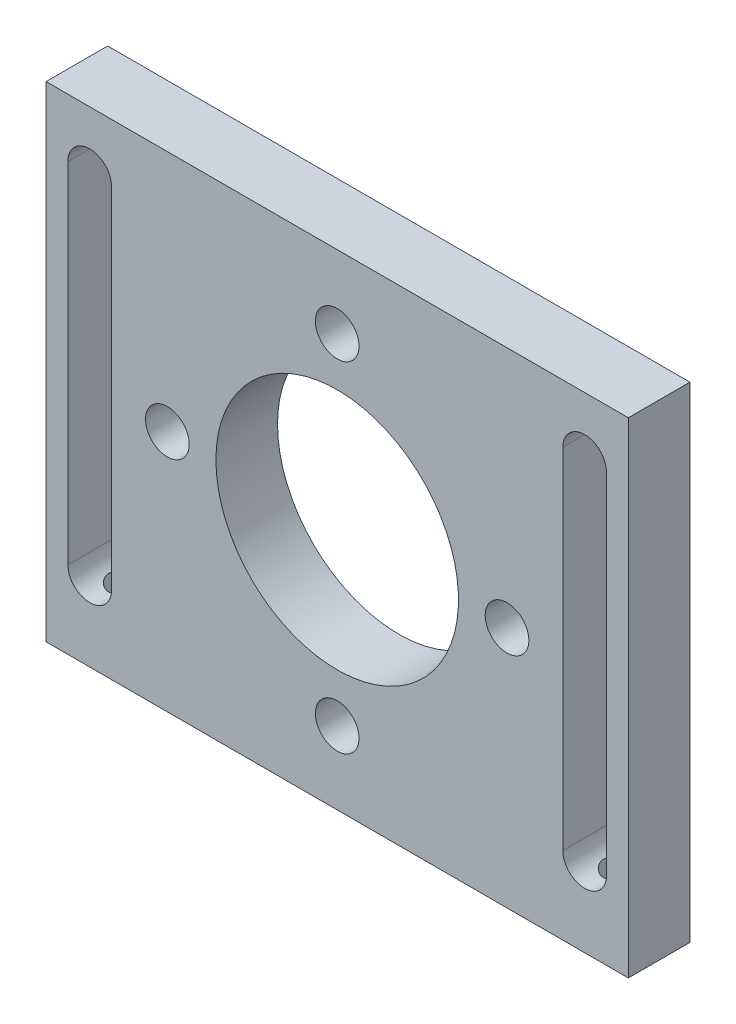
ISO-10303-21;
HEADER;
FILE_DESCRIPTION(('STEP AP214'),'2;1');
FILE_NAME('part.step','',(''),(''),'','','');
FILE_SCHEMA(('AUTOMOTIVE_DESIGN { 1 0 10303 214 1 1 1 1 }'));
ENDSEC;
DATA;
#1=APPLICATION_CONTEXT('core data for automotive mechanical design processes');
#2=APPLICATION_PROTOCOL_DEFINITION('international standard','automotive_design',2000,#1);
#3=PRODUCT_CONTEXT('',#1,'mechanical');
#4=PRODUCT('Part','Part','',(#3));
#5=PRODUCT_RELATED_PRODUCT_CATEGORY('part','',(#4));
#6=PRODUCT_DEFINITION_FORMATION('','',#4);
#7=PRODUCT_DEFINITION_CONTEXT('part definition',#1,'design');
#8=PRODUCT_DEFINITION('design','',#6,#7);
#9=PRODUCT_DEFINITION_SHAPE('','',#8);
#10=(LENGTH_UNIT() NAMED_UNIT(*) SI_UNIT(.MILLI.,.METRE.));
#11=(NAMED_UNIT(*) PLANE_ANGLE_UNIT() SI_UNIT($,.RADIAN.));
#12=(NAMED_UNIT(*) SI_UNIT($,.STERADIAN.) SOLID_ANGLE_UNIT());
#13=UNCERTAINTY_MEASURE_WITH_UNIT(LENGTH_MEASURE(1.E-05),#10,'distance_accuracy_value','');
#14=(GEOMETRIC_REPRESENTATION_CONTEXT(3) GLOBAL_UNCERTAINTY_ASSIGNED_CONTEXT((#13)) GLOBAL_UNIT_ASSIGNED_CONTEXT((#10,
#11,#12)) REPRESENTATION_CONTEXT('',''));
#15=CARTESIAN_POINT('',(0.,0.,0.));
#16=DIRECTION('',(0.,0.,1.));
#17=DIRECTION('',(1.,0.,0.));
#18=AXIS2_PLACEMENT_3D('',#15,#16,#17);
#19=CARTESIAN_POINT('',(30.,25.,6.35));
#20=DIRECTION('',(1.,0.,0.));
#21=DIRECTION('',(0.,1.,0.));
#22=AXIS2_PLACEMENT_3D('',#19,#20,#21);
#23=PLANE('',#22);
#24=DIRECTION('',(0.,-1.,0.));
#25=VECTOR('',#24,1.);
#26=CARTESIAN_POINT('',(30.,25.,0.));
#27=LINE('',#26,#25);
#28=CARTESIAN_POINT('',(30.,25.,0.));
#29=VERTEX_POINT('',#28);
#30=CARTESIAN_POINT('',(30.,-25.,0.));
#31=VERTEX_POINT('',#30);
#32=EDGE_CURVE('E186',#29,#31,#27,.T.);
#33=ORIENTED_EDGE('',*,*,#32,.F.);
#34=DIRECTION('',(0.,0.,-1.));
#35=VECTOR('',#34,1.);
#36=CARTESIAN_POINT('',(30.,25.,6.35));
#37=LINE('',#36,#35);
#38=CARTESIAN_POINT('',(30.,25.,6.35));
#39=VERTEX_POINT('',#38);
#40=EDGE_CURVE('E217',#39,#29,#37,.T.);
#41=ORIENTED_EDGE('',*,*,#40,.F.);
#42=DIRECTION('',(0.,-1.,0.));
#43=VECTOR('',#42,1.);
#44=CARTESIAN_POINT('',(30.,25.,6.35));
#45=LINE('',#44,#43);
#46=CARTESIAN_POINT('',(30.,-25.,6.35));
#47=VERTEX_POINT('',#46);
#48=EDGE_CURVE('E193',#39,#47,#45,.T.);
#49=ORIENTED_EDGE('',*,*,#48,.T.);
#50=DIRECTION('',(0.,0.,-1.));
#51=VECTOR('',#50,1.);
#52=CARTESIAN_POINT('',(30.,-25.,6.35));
#53=LINE('',#52,#51);
#54=EDGE_CURVE('E206',#47,#31,#53,.T.);
#55=ORIENTED_EDGE('',*,*,#54,.T.);
#56=EDGE_LOOP('',(#33,#41,#49,#55));
#57=FACE_BOUND('',#56,.T.);
#58=ADVANCED_FACE('F32',(#57),#23,.T.);
#59=CARTESIAN_POINT('',(-30.,25.,6.35));
#60=DIRECTION('',(0.,1.,0.));
#61=DIRECTION('',(0.,0.,1.));
#62=AXIS2_PLACEMENT_3D('',#59,#60,#61);
#63=PLANE('',#62);
#64=DIRECTION('',(1.,0.,0.));
#65=VECTOR('',#64,1.);
#66=CARTESIAN_POINT('',(-30.,25.,0.));
#67=LINE('',#66,#65);
#68=CARTESIAN_POINT('',(-30.,25.,0.));
#69=VERTEX_POINT('',#68);
#70=EDGE_CURVE('E197',#69,#29,#67,.T.);
#71=ORIENTED_EDGE('',*,*,#70,.F.);
#72=DIRECTION('',(0.,0.,-1.));
#73=VECTOR('',#72,1.);
#74=CARTESIAN_POINT('',(-30.,25.,6.35));
#75=LINE('',#74,#73);
#76=CARTESIAN_POINT('',(-30.,25.,6.35));
#77=VERTEX_POINT('',#76);
#78=EDGE_CURVE('E220',#77,#69,#75,.T.);
#79=ORIENTED_EDGE('',*,*,#78,.F.);
#80=DIRECTION('',(1.,0.,0.));
#81=VECTOR('',#80,1.);
#82=CARTESIAN_POINT('',(-30.,25.,6.35));
#83=LINE('',#82,#81);
#84=EDGE_CURVE('E203',#77,#39,#83,.T.);
#85=ORIENTED_EDGE('',*,*,#84,.T.);
#86=ORIENTED_EDGE('',*,*,#40,.T.);
#87=EDGE_LOOP('',(#71,#79,#85,#86));
#88=FACE_BOUND('',#87,.T.);
#89=ADVANCED_FACE('F261',(#88),#63,.T.);
#90=CARTESIAN_POINT('',(-30.,-25.,6.35));
#91=DIRECTION('',(-1.,0.,0.));
#92=DIRECTION('',(0.,-1.,0.));
#93=AXIS2_PLACEMENT_3D('',#90,#91,#92);
#94=PLANE('',#93);
#95=DIRECTION('',(0.,1.,0.));
#96=VECTOR('',#95,1.);
#97=CARTESIAN_POINT('',(-30.,-25.,0.));
#98=LINE('',#97,#96);
#99=CARTESIAN_POINT('',(-30.,-25.,0.));
#100=VERTEX_POINT('',#99);
#101=EDGE_CURVE('E212',#100,#69,#98,.T.);
#102=ORIENTED_EDGE('',*,*,#101,.F.);
#103=DIRECTION('',(0.,0.,-1.));
#104=VECTOR('',#103,1.);
#105=CARTESIAN_POINT('',(-30.,-25.,6.35));
#106=LINE('',#105,#104);
#107=CARTESIAN_POINT('',(-30.,-25.,6.35));
#108=VERTEX_POINT('',#107);
#109=EDGE_CURVE('E222',#108,#100,#106,.T.);
#110=ORIENTED_EDGE('',*,*,#109,.F.);
#111=DIRECTION('',(0.,1.,0.));
#112=VECTOR('',#111,1.);
#113=CARTESIAN_POINT('',(-30.,-25.,6.35));
#114=LINE('',#113,#112);
#115=EDGE_CURVE('E200',#108,#77,#114,.T.);
#116=ORIENTED_EDGE('',*,*,#115,.T.);
#117=ORIENTED_EDGE('',*,*,#78,.T.);
#118=EDGE_LOOP('',(#102,#110,#116,#117));
#119=FACE_BOUND('',#118,.T.);
#120=ADVANCED_FACE('F267',(#119),#94,.T.);
#121=CARTESIAN_POINT('',(30.,-25.,6.35));
#122=DIRECTION('',(0.,-1.,0.));
#123=DIRECTION('',(0.,0.,-1.));
#124=AXIS2_PLACEMENT_3D('',#121,#122,#123);
#125=PLANE('',#124);
#126=CARTESIAN_POINT('',(25.5,-25.,3.175));
#127=DIRECTION('',(0.,-1.,0.));
#128=DIRECTION('',(0.,0.,-1.));
#129=AXIS2_PLACEMENT_3D('',#126,#127,#128);
#130=CIRCLE('',#129,1.24999999999999);
#131=CARTESIAN_POINT('',(25.5,-25.,1.92500000000001));
#132=VERTEX_POINT('',#131);
#133=EDGE_CURVE('E335',#132,#132,#130,.T.);
#134=ORIENTED_EDGE('',*,*,#133,.F.);
#135=EDGE_LOOP('',(#134));
#136=FACE_BOUND('',#135,.T.);
#137=CARTESIAN_POINT('',(-25.5,-25.,3.175));
#138=DIRECTION('',(0.,-1.,0.));
#139=DIRECTION('',(0.,0.,-1.));
#140=AXIS2_PLACEMENT_3D('',#137,#138,#139);
#141=CIRCLE('',#140,1.24999999999999);
#142=CARTESIAN_POINT('',(-25.5,-25.,1.92500000000001));
#143=VERTEX_POINT('',#142);
#144=EDGE_CURVE('E319',#143,#143,#141,.T.);
#145=ORIENTED_EDGE('',*,*,#144,.F.);
#146=EDGE_LOOP('',(#145));
#147=FACE_BOUND('',#146,.T.);
#148=DIRECTION('',(-1.,0.,0.));
#149=VECTOR('',#148,1.);
#150=CARTESIAN_POINT('',(30.,-25.,0.));
#151=LINE('',#150,#149);
#152=EDGE_CURVE('E209',#31,#100,#151,.T.);
#153=ORIENTED_EDGE('',*,*,#152,.F.);
#154=ORIENTED_EDGE('',*,*,#54,.F.);
#155=DIRECTION('',(-1.,0.,0.));
#156=VECTOR('',#155,1.);
#157=CARTESIAN_POINT('',(30.,-25.,6.35));
#158=LINE('',#157,#156);
#159=EDGE_CURVE('E196',#47,#108,#158,.T.);
#160=ORIENTED_EDGE('',*,*,#159,.T.);
#161=ORIENTED_EDGE('',*,*,#109,.T.);
#162=EDGE_LOOP('',(#153,#154,#160,#161));
#163=FACE_BOUND('',#162,.T.);
#164=ADVANCED_FACE('F273',(#136,#147,#163),#125,.T.);
#165=CARTESIAN_POINT('',(0.,0.,6.35));
#166=DIRECTION('',(0.,0.,-1.));
#167=DIRECTION('',(-1.,0.,0.));
#168=AXIS2_PLACEMENT_3D('',#165,#166,#167);
#169=PLANE('',#168);
#170=CARTESIAN_POINT('',(0.,17.5,6.34999999999999));
#171=DIRECTION('',(0.,0.,-1.));
#172=DIRECTION('',(-1.,0.,0.));
#173=AXIS2_PLACEMENT_3D('',#170,#171,#172);
#174=CIRCLE('',#173,2.24999999999999);
#175=CARTESIAN_POINT('',(-2.24999999999999,17.5,6.34999999999999));
#176=VERTEX_POINT('',#175);
#177=EDGE_CURVE('E308',#176,#176,#174,.T.);
#178=ORIENTED_EDGE('',*,*,#177,.T.);
#179=EDGE_LOOP('',(#178));
#180=FACE_BOUND('',#179,.T.);
#181=CARTESIAN_POINT('',(-17.5000000000005,4.95236783133562E-13,6.34999999999999));
#182=DIRECTION('',(0.,0.,-1.));
#183=DIRECTION('',(-1.,0.,0.));
#184=AXIS2_PLACEMENT_3D('',#181,#182,#183);
#185=CIRCLE('',#184,2.24999999999999);
#186=CARTESIAN_POINT('',(-19.7500000000005,4.95236783133562E-13,6.34999999999999));
#187=VERTEX_POINT('',#186);
#188=EDGE_CURVE('E303',#187,#187,#185,.T.);
#189=ORIENTED_EDGE('',*,*,#188,.T.);
#190=EDGE_LOOP('',(#189));
#191=FACE_BOUND('',#190,.T.);
#192=CARTESIAN_POINT('',(-9.90473566267125E-13,-17.5,6.34999999999999));
#193=DIRECTION('',(0.,0.,-1.));
#194=DIRECTION('',(-1.,0.,0.));
#195=AXIS2_PLACEMENT_3D('',#192,#193,#194);
#196=CIRCLE('',#195,2.24999999999999);
#197=CARTESIAN_POINT('',(-2.25000000000098,-17.5,6.34999999999999));
#198=VERTEX_POINT('',#197);
#199=EDGE_CURVE('E299',#198,#198,#196,.T.);
#200=ORIENTED_EDGE('',*,*,#199,.T.);
#201=EDGE_LOOP('',(#200));
#202=FACE_BOUND('',#201,.T.);
#203=CARTESIAN_POINT('',(17.4999999999995,-4.93093651235055E-13,6.34999999999999));
#204=DIRECTION('',(0.,0.,-1.));
#205=DIRECTION('',(-1.,0.,0.));
#206=AXIS2_PLACEMENT_3D('',#203,#204,#205);
#207=CIRCLE('',#206,2.24999999999999);
#208=CARTESIAN_POINT('',(15.2499999999995,-4.93093651235055E-13,6.34999999999999));
#209=VERTEX_POINT('',#208);
#210=EDGE_CURVE('E296',#209,#209,#207,.T.);
#211=ORIENTED_EDGE('',*,*,#210,.T.);
#212=EDGE_LOOP('',(#211));
#213=FACE_BOUND('',#212,.T.);
#214=CARTESIAN_POINT('',(-1.11022302462516E-13,-1.11022302462516E-13,6.34999999999999));
#215=DIRECTION('',(0.,0.,-1.));
#216=DIRECTION('',(-1.,0.,0.));
#217=AXIS2_PLACEMENT_3D('',#214,#215,#216);
#218=CIRCLE('',#217,12.5000000000001);
#219=CARTESIAN_POINT('',(-12.5000000000002,-1.11022302462516E-13,6.34999999999999));
#220=VERTEX_POINT('',#219);
#221=EDGE_CURVE('E145',#220,#220,#218,.T.);
#222=ORIENTED_EDGE('',*,*,#221,.T.);
#223=EDGE_LOOP('',(#222));
#224=FACE_BOUND('',#223,.T.);
#225=DIRECTION('',(0.,1.,0.));
#226=VECTOR('',#225,1.);
#227=CARTESIAN_POINT('',(27.75,-17.,6.35));
#228=LINE('',#227,#226);
#229=CARTESIAN_POINT('',(27.75,-17.,6.35));
#230=VERTEX_POINT('',#229);
#231=CARTESIAN_POINT('',(27.75,19.,6.35));
#232=VERTEX_POINT('',#231);
#233=EDGE_CURVE('E151',#230,#232,#228,.T.);
#234=ORIENTED_EDGE('',*,*,#233,.F.);
#235=CARTESIAN_POINT('',(25.5,-17.,6.35));
#236=DIRECTION('',(0.,0.,1.));
#237=DIRECTION('',(1.,0.,0.));
#238=AXIS2_PLACEMENT_3D('',#235,#236,#237);
#239=CIRCLE('',#238,2.24999999999999);
#240=CARTESIAN_POINT('',(23.25,-17.,6.35));
#241=VERTEX_POINT('',#240);
#242=EDGE_CURVE('E47',#241,#230,#239,.T.);
#243=ORIENTED_EDGE('',*,*,#242,.F.);
#244=DIRECTION('',(0.,-1.,0.));
#245=VECTOR('',#244,1.);
#246=CARTESIAN_POINT('',(23.25,19.,6.35));
#247=LINE('',#246,#245);
#248=CARTESIAN_POINT('',(23.25,19.,6.35));
#249=VERTEX_POINT('',#248);
#250=EDGE_CURVE('E139',#249,#241,#247,.T.);
#251=ORIENTED_EDGE('',*,*,#250,.F.);
#252=CARTESIAN_POINT('',(25.5,19.,6.35));
#253=DIRECTION('',(0.,0.,1.));
#254=DIRECTION('',(1.,0.,0.));
#255=AXIS2_PLACEMENT_3D('',#252,#253,#254);
#256=CIRCLE('',#255,2.25);
#257=EDGE_CURVE('E142',#232,#249,#256,.T.);
#258=ORIENTED_EDGE('',*,*,#257,.F.);
#259=EDGE_LOOP('',(#234,#243,#251,#258));
#260=FACE_BOUND('',#259,.T.);
#261=DIRECTION('',(0.,1.,0.));
#262=VECTOR('',#261,1.);
#263=CARTESIAN_POINT('',(-27.75,-17.,6.35));
#264=LINE('',#263,#262);
#265=CARTESIAN_POINT('',(-27.75,-17.,6.35));
#266=VERTEX_POINT('',#265);
#267=CARTESIAN_POINT('',(-27.75,19.,6.35));
#268=VERTEX_POINT('',#267);
#269=EDGE_CURVE('E171',#266,#268,#264,.T.);
#270=ORIENTED_EDGE('',*,*,#269,.T.);
#271=CARTESIAN_POINT('',(-25.5,19.,6.35));
#272=DIRECTION('',(0.,0.,-1.));
#273=DIRECTION('',(-1.,0.,0.));
#274=AXIS2_PLACEMENT_3D('',#271,#272,#273);
#275=CIRCLE('',#274,2.25);
#276=CARTESIAN_POINT('',(-23.25,19.,6.35));
#277=VERTEX_POINT('',#276);
#278=EDGE_CURVE('E161',#268,#277,#275,.T.);
#279=ORIENTED_EDGE('',*,*,#278,.T.);
#280=DIRECTION('',(0.,-1.,0.));
#281=VECTOR('',#280,1.);
#282=CARTESIAN_POINT('',(-23.25,19.,6.35));
#283=LINE('',#282,#281);
#284=CARTESIAN_POINT('',(-23.25,-17.,6.35));
#285=VERTEX_POINT('',#284);
#286=EDGE_CURVE('E164',#277,#285,#283,.T.);
#287=ORIENTED_EDGE('',*,*,#286,.T.);
#288=CARTESIAN_POINT('',(-25.5,-17.,6.35));
#289=DIRECTION('',(0.,0.,-1.));
#290=DIRECTION('',(-1.,0.,0.));
#291=AXIS2_PLACEMENT_3D('',#288,#289,#290);
#292=CIRCLE('',#291,2.24999999999999);
#293=EDGE_CURVE('E168',#285,#266,#292,.T.);
#294=ORIENTED_EDGE('',*,*,#293,.T.);
#295=EDGE_LOOP('',(#270,#279,#287,#294));
#296=FACE_BOUND('',#295,.T.);
#297=ORIENTED_EDGE('',*,*,#48,.F.);
#298=ORIENTED_EDGE('',*,*,#84,.F.);
#299=ORIENTED_EDGE('',*,*,#115,.F.);
#300=ORIENTED_EDGE('',*,*,#159,.F.);
#301=EDGE_LOOP('',(#297,#298,#299,#300));
#302=FACE_BOUND('',#301,.T.);
#303=ADVANCED_FACE('F342',(#180,#191,#202,#213,#224,#260,#296,#302),#169,.F.);
#304=CARTESIAN_POINT('',(0.,0.,0.));
#305=DIRECTION('',(0.,0.,-1.));
#306=DIRECTION('',(-1.,0.,0.));
#307=AXIS2_PLACEMENT_3D('',#304,#305,#306);
#308=PLANE('',#307);
#309=CARTESIAN_POINT('',(17.4999999999995,-4.93093651235055E-13,0.));
#310=DIRECTION('',(0.,0.,-1.));
#311=DIRECTION('',(-1.,0.,0.));
#312=AXIS2_PLACEMENT_3D('',#309,#310,#311);
#313=CIRCLE('',#312,4.69999999997033);
#314=CARTESIAN_POINT('',(12.8000000000292,-4.93093651235055E-13,0.));
#315=VERTEX_POINT('',#314);
#316=EDGE_CURVE('E236',#315,#315,#313,.F.);
#317=ORIENTED_EDGE('',*,*,#316,.T.);
#318=EDGE_LOOP('',(#317));
#319=FACE_BOUND('',#318,.T.);
#320=CARTESIAN_POINT('',(-9.90473566267125E-13,-17.5,0.));
#321=DIRECTION('',(0.,0.,-1.));
#322=DIRECTION('',(-1.,0.,0.));
#323=AXIS2_PLACEMENT_3D('',#320,#321,#322);
#324=CIRCLE('',#323,4.69999999997033);
#325=CARTESIAN_POINT('',(-4.69999999997132,-17.5,0.));
#326=VERTEX_POINT('',#325);
#327=EDGE_CURVE('E233',#326,#326,#324,.F.);
#328=ORIENTED_EDGE('',*,*,#327,.T.);
#329=EDGE_LOOP('',(#328));
#330=FACE_BOUND('',#329,.T.);
#331=CARTESIAN_POINT('',(0.,17.5,0.));
#332=DIRECTION('',(0.,0.,-1.));
#333=DIRECTION('',(-1.,0.,0.));
#334=AXIS2_PLACEMENT_3D('',#331,#332,#333);
#335=CIRCLE('',#334,4.69999999997033);
#336=CARTESIAN_POINT('',(-4.69999999997033,17.5,0.));
#337=VERTEX_POINT('',#336);
#338=EDGE_CURVE('E230',#337,#337,#335,.F.);
#339=ORIENTED_EDGE('',*,*,#338,.T.);
#340=EDGE_LOOP('',(#339));
#341=FACE_BOUND('',#340,.T.);
#342=CARTESIAN_POINT('',(-17.5000000000005,4.95236783133562E-13,0.));
#343=DIRECTION('',(0.,0.,-1.));
#344=DIRECTION('',(-1.,0.,0.));
#345=AXIS2_PLACEMENT_3D('',#342,#343,#344);
#346=CIRCLE('',#345,4.69999999997033);
#347=CARTESIAN_POINT('',(-22.1999999999708,4.95236783133562E-13,0.));
#348=VERTEX_POINT('',#347);
#349=EDGE_CURVE('E227',#348,#348,#346,.F.);
#350=ORIENTED_EDGE('',*,*,#349,.T.);
#351=EDGE_LOOP('',(#350));
#352=FACE_BOUND('',#351,.T.);
#353=CARTESIAN_POINT('',(-1.11022302462516E-13,-1.11022302462516E-13,0.));
#354=DIRECTION('',(0.,0.,-1.));
#355=DIRECTION('',(-1.,0.,0.));
#356=AXIS2_PLACEMENT_3D('',#353,#354,#355);
#357=CIRCLE('',#356,12.5000000000001);
#358=CARTESIAN_POINT('',(-12.5000000000002,-1.11022302462516E-13,0.));
#359=VERTEX_POINT('',#358);
#360=EDGE_CURVE('E298',#359,#359,#357,.T.);
#361=ORIENTED_EDGE('',*,*,#360,.F.);
#362=EDGE_LOOP('',(#361));
#363=FACE_BOUND('',#362,.T.);
#364=CARTESIAN_POINT('',(25.5,-17.,0.));
#365=DIRECTION('',(0.,0.,1.));
#366=DIRECTION('',(1.,0.,0.));
#367=AXIS2_PLACEMENT_3D('',#364,#365,#366);
#368=CIRCLE('',#367,2.24999999999999);
#369=CARTESIAN_POINT('',(23.25,-17.,0.));
#370=VERTEX_POINT('',#369);
#371=CARTESIAN_POINT('',(27.75,-17.,0.));
#372=VERTEX_POINT('',#371);
#373=EDGE_CURVE('E123',#370,#372,#368,.T.);
#374=ORIENTED_EDGE('',*,*,#373,.T.);
#375=DIRECTION('',(0.,1.,0.));
#376=VECTOR('',#375,1.);
#377=CARTESIAN_POINT('',(27.75,-17.,0.));
#378=LINE('',#377,#376);
#379=CARTESIAN_POINT('',(27.75,19.,0.));
#380=VERTEX_POINT('',#379);
#381=EDGE_CURVE('E132',#372,#380,#378,.T.);
#382=ORIENTED_EDGE('',*,*,#381,.T.);
#383=CARTESIAN_POINT('',(25.5,19.,0.));
#384=DIRECTION('',(0.,0.,1.));
#385=DIRECTION('',(1.,0.,0.));
#386=AXIS2_PLACEMENT_3D('',#383,#384,#385);
#387=CIRCLE('',#386,2.25);
#388=CARTESIAN_POINT('',(23.25,19.,0.));
#389=VERTEX_POINT('',#388);
#390=EDGE_CURVE('E55',#380,#389,#387,.T.);
#391=ORIENTED_EDGE('',*,*,#390,.T.);
#392=DIRECTION('',(0.,-1.,0.));
#393=VECTOR('',#392,1.);
#394=CARTESIAN_POINT('',(23.25,19.,0.));
#395=LINE('',#394,#393);
#396=EDGE_CURVE('E129',#389,#370,#395,.T.);
#397=ORIENTED_EDGE('',*,*,#396,.T.);
#398=EDGE_LOOP('',(#374,#382,#391,#397));
#399=FACE_BOUND('',#398,.T.);
#400=CARTESIAN_POINT('',(-25.5,19.,0.));
#401=DIRECTION('',(0.,0.,-1.));
#402=DIRECTION('',(-1.,0.,0.));
#403=AXIS2_PLACEMENT_3D('',#400,#401,#402);
#404=CIRCLE('',#403,2.25);
#405=CARTESIAN_POINT('',(-27.75,19.,0.));
#406=VERTEX_POINT('',#405);
#407=CARTESIAN_POINT('',(-23.25,19.,0.));
#408=VERTEX_POINT('',#407);
#409=EDGE_CURVE('E157',#406,#408,#404,.T.);
#410=ORIENTED_EDGE('',*,*,#409,.F.);
#411=DIRECTION('',(0.,1.,0.));
#412=VECTOR('',#411,1.);
#413=CARTESIAN_POINT('',(-27.75,-17.,0.));
#414=LINE('',#413,#412);
#415=CARTESIAN_POINT('',(-27.75,-17.,0.));
#416=VERTEX_POINT('',#415);
#417=EDGE_CURVE('E165',#416,#406,#414,.T.);
#418=ORIENTED_EDGE('',*,*,#417,.F.);
#419=CARTESIAN_POINT('',(-25.5,-17.,0.));
#420=DIRECTION('',(0.,0.,-1.));
#421=DIRECTION('',(-1.,0.,0.));
#422=AXIS2_PLACEMENT_3D('',#419,#420,#421);
#423=CIRCLE('',#422,2.24999999999999);
#424=CARTESIAN_POINT('',(-23.25,-17.,0.));
#425=VERTEX_POINT('',#424);
#426=EDGE_CURVE('E179',#425,#416,#423,.T.);
#427=ORIENTED_EDGE('',*,*,#426,.F.);
#428=DIRECTION('',(0.,-1.,0.));
#429=VECTOR('',#428,1.);
#430=CARTESIAN_POINT('',(-23.25,19.,0.));
#431=LINE('',#430,#429);
#432=EDGE_CURVE('E176',#408,#425,#431,.T.);
#433=ORIENTED_EDGE('',*,*,#432,.F.);
#434=EDGE_LOOP('',(#410,#418,#427,#433));
#435=FACE_BOUND('',#434,.T.);
#436=ORIENTED_EDGE('',*,*,#32,.T.);
#437=ORIENTED_EDGE('',*,*,#152,.T.);
#438=ORIENTED_EDGE('',*,*,#101,.T.);
#439=ORIENTED_EDGE('',*,*,#70,.T.);
#440=EDGE_LOOP('',(#436,#437,#438,#439));
#441=FACE_BOUND('',#440,.T.);
#442=ADVANCED_FACE('F136',(#319,#330,#341,#352,#363,#399,#435,#441),#308,.T.);
#443=CARTESIAN_POINT('',(-25.5,19.,6.35));
#444=DIRECTION('',(0.,0.,-1.));
#445=DIRECTION('',(-1.,0.,0.));
#446=AXIS2_PLACEMENT_3D('',#443,#444,#445);
#447=CYLINDRICAL_SURFACE('',#446,2.25);
#448=ORIENTED_EDGE('',*,*,#409,.T.);
#449=DIRECTION('',(0.,0.,-1.));
#450=VECTOR('',#449,1.);
#451=CARTESIAN_POINT('',(-23.25,19.,6.35));
#452=LINE('',#451,#450);
#453=EDGE_CURVE('E174',#277,#408,#452,.T.);
#454=ORIENTED_EDGE('',*,*,#453,.F.);
#455=ORIENTED_EDGE('',*,*,#278,.F.);
#456=DIRECTION('',(0.,0.,-1.));
#457=VECTOR('',#456,1.);
#458=CARTESIAN_POINT('',(-27.75,19.,6.35));
#459=LINE('',#458,#457);
#460=EDGE_CURVE('E184',#268,#406,#459,.T.);
#461=ORIENTED_EDGE('',*,*,#460,.T.);
#462=EDGE_LOOP('',(#448,#454,#455,#461));
#463=FACE_BOUND('',#462,.T.);
#464=ADVANCED_FACE('F362',(#463),#447,.F.);
#465=CARTESIAN_POINT('',(-27.75,-17.,6.35));
#466=DIRECTION('',(-1.,0.,0.));
#467=DIRECTION('',(0.,0.,1.));
#468=AXIS2_PLACEMENT_3D('',#465,#466,#467);
#469=PLANE('',#468);
#470=ORIENTED_EDGE('',*,*,#417,.T.);
#471=ORIENTED_EDGE('',*,*,#460,.F.);
#472=ORIENTED_EDGE('',*,*,#269,.F.);
#473=DIRECTION('',(0.,0.,-1.));
#474=VECTOR('',#473,1.);
#475=CARTESIAN_POINT('',(-27.75,-17.,6.35));
#476=LINE('',#475,#474);
#477=EDGE_CURVE('E187',#266,#416,#476,.T.);
#478=ORIENTED_EDGE('',*,*,#477,.T.);
#479=EDGE_LOOP('',(#470,#471,#472,#478));
#480=FACE_BOUND('',#479,.T.);
#481=ADVANCED_FACE('F369',(#480),#469,.F.);
#482=CARTESIAN_POINT('',(-25.5,-17.,6.35));
#483=DIRECTION('',(0.,0.,-1.));
#484=DIRECTION('',(-1.,0.,0.));
#485=AXIS2_PLACEMENT_3D('',#482,#483,#484);
#486=CYLINDRICAL_SURFACE('',#485,2.24999999999999);
#487=CARTESIAN_POINT('',(-25.5,-19.25,1.92500000000001));
#488=CARTESIAN_POINT('',(-25.4351209548962,-19.2500015723267,1.92499816740441));
#489=CARTESIAN_POINT('',(-25.3702524759768,-19.2471698495017,1.93007328517846));
#490=CARTESIAN_POINT('',(-25.2425319528804,-19.2361396538124,1.95009593073591));
#491=CARTESIAN_POINT('',(-25.1796802851913,-19.227940184969,1.96504529067823));
#492=CARTESIAN_POINT('',(-25.0579563315292,-19.2070121352988,2.00403007853263));
#493=CARTESIAN_POINT('',(-24.9990703520008,-19.1943002029893,2.02803212706117));
#494=CARTESIAN_POINT('',(-24.8862701412099,-19.1654628853509,2.08421583443204));
#495=CARTESIAN_POINT('',(-24.8323571088202,-19.1493366799843,2.11639945869263));
#496=CARTESIAN_POINT('',(-24.726831924282,-19.1137699071885,2.19054334125147));
#497=CARTESIAN_POINT('',(-24.6756404722195,-19.094176844105,2.23302782386941));
#498=CARTESIAN_POINT('',(-24.5807059862036,-19.0542773672776,2.32541633368337));
#499=CARTESIAN_POINT('',(-24.5369705594103,-19.0339702501784,2.37532784239141));
#500=CARTESIAN_POINT('',(-24.4537146804888,-18.9925262319752,2.48715760511563));
#501=CARTESIAN_POINT('',(-24.4150705893268,-18.9715138059636,2.54978005060354));
#502=CARTESIAN_POINT('',(-24.3490315869242,-18.9337084530971,2.68184569563726));
#503=CARTESIAN_POINT('',(-24.3216205709157,-18.9169094989322,2.75127895219248));
#504=CARTESIAN_POINT('',(-24.2838589008397,-18.8931165088077,2.88002861147382));
#505=CARTESIAN_POINT('',(-24.2711336088253,-18.8848038835762,2.93840483929615));
#506=CARTESIAN_POINT('',(-24.254160645296,-18.8736308253758,3.05686781955793));
#507=CARTESIAN_POINT('',(-24.2499046171217,-18.8707650181334,3.11695282648604));
#508=CARTESIAN_POINT('',(-24.2500987738263,-18.8708946342506,3.23716554758626));
#509=CARTESIAN_POINT('',(-24.2545584922971,-18.8738964758527,3.29729323652846));
#510=CARTESIAN_POINT('',(-24.2719477604276,-18.8853359825927,3.41578896920021));
#511=CARTESIAN_POINT('',(-24.2848828175938,-18.8937771823148,3.47415584288779));
#512=CARTESIAN_POINT('',(-24.3186117464533,-18.9149971209608,3.58771612399658));
#513=CARTESIAN_POINT('',(-24.3394073654019,-18.9277768241881,3.64290882271337));
#514=CARTESIAN_POINT('',(-24.3881487157813,-18.9562930306086,3.74920376192739));
#515=CARTESIAN_POINT('',(-24.4160972398671,-18.9720306880147,3.80030439453621));
#516=CARTESIAN_POINT('',(-24.4832678253128,-19.0075874826177,3.9052066476696));
#517=CARTESIAN_POINT('',(-24.5235576469465,-19.0276634258412,3.95823862670866));
#518=CARTESIAN_POINT('',(-24.6120158739858,-19.0679334673907,4.0572684763165));
#519=CARTESIAN_POINT('',(-24.6601904969501,-19.0881276467356,4.10326073988032));
#520=CARTESIAN_POINT('',(-24.7689304991533,-19.1287870455705,4.19157447515284));
#521=CARTESIAN_POINT('',(-24.8302569194643,-19.149072188726,4.23305109606081));
#522=CARTESIAN_POINT('',(-24.960260986938,-19.1853427752959,4.30490527437183));
#523=CARTESIAN_POINT('',(-25.0289337564396,-19.2013310471802,4.3352901378082));
#524=CARTESIAN_POINT('',(-25.1666259869222,-19.2261854674445,4.38175541792631));
#525=CARTESIAN_POINT('',(-25.2352755578347,-19.2354762547661,4.39869738469538));
#526=CARTESIAN_POINT('',(-25.3749879065163,-19.2476148061201,4.42073685262216));
#527=CARTESIAN_POINT('',(-25.4460484965173,-19.2504682606717,4.42584481499534));
#528=CARTESIAN_POINT('',(-25.5798684960307,-19.2494639570856,4.4240333905764));
#529=CARTESIAN_POINT('',(-25.6426558778569,-19.2463302252997,4.41841162577032));
#530=CARTESIAN_POINT('',(-25.766230694671,-19.2350548029049,4.39792407134506));
#531=CARTESIAN_POINT('',(-25.8270180646012,-19.2269129495579,4.38305798133288));
#532=CARTESIAN_POINT('',(-25.9448130210737,-19.206401474865,4.34481434480667));
#533=CARTESIAN_POINT('',(-26.0018336375591,-19.1940474493538,4.32146817578071));
#534=CARTESIAN_POINT('',(-26.111212244299,-19.1661278759621,4.26708690882508));
#535=CARTESIAN_POINT('',(-26.1635689817317,-19.1505614688665,4.23604975334168));
#536=CARTESIAN_POINT('',(-26.2679354105119,-19.1156809210964,4.1635439040816));
#537=CARTESIAN_POINT('',(-26.3193527685384,-19.0961458529043,4.12132962390589));
#538=CARTESIAN_POINT('',(-26.4147695698292,-19.0563015860909,4.02945346339166));
#539=CARTESIAN_POINT('',(-26.4587607471526,-19.0359915552907,3.97978339878615));
#540=CARTESIAN_POINT('',(-26.5425598073516,-18.9944843116866,3.86846917619265));
#541=CARTESIAN_POINT('',(-26.5815000784041,-18.9734037776624,3.80612286623772));
#542=CARTESIAN_POINT('',(-26.648189663038,-18.9353663139667,3.67457767081017));
#543=CARTESIAN_POINT('',(-26.6759548047087,-18.9184035656181,3.60538865151106));
#544=CARTESIAN_POINT('',(-26.7144444488386,-18.8942095223585,3.47689151494468));
#545=CARTESIAN_POINT('',(-26.7275144306994,-18.8856868621662,3.41852936383199));
#546=CARTESIAN_POINT('',(-26.7451696286077,-18.8740782279343,3.30002668132841));
#547=CARTESIAN_POINT('',(-26.7497633199199,-18.8709868234446,3.23988798747959));
#548=CARTESIAN_POINT('',(-26.7502190954589,-18.8706823124973,3.11948912143443));
#549=CARTESIAN_POINT('',(-26.7460703095224,-18.873476524056,3.05922889118885));
#550=CARTESIAN_POINT('',(-26.7292582158663,-18.8845480482418,2.94041600736518));
#551=CARTESIAN_POINT('',(-26.7165894710623,-18.8928288621409,2.88186446911444));
#552=CARTESIAN_POINT('',(-26.6833974160283,-18.9137526719087,2.76809056729007));
#553=CARTESIAN_POINT('',(-26.6628978363351,-18.9263824773188,2.71285872332491));
#554=CARTESIAN_POINT('',(-26.6147472101062,-18.9546396874383,2.60644585823974));
#555=CARTESIAN_POINT('',(-26.5870934087331,-18.9702682462613,2.55526640748974));
#556=CARTESIAN_POINT('',(-26.5205963127424,-19.005617944973,2.45021885371193));
#557=CARTESIAN_POINT('',(-26.4806948125274,-19.0256009088526,2.39710779350179));
#558=CARTESIAN_POINT('',(-26.3930296551658,-19.0657505338035,2.29785244098253));
#559=CARTESIAN_POINT('',(-26.3452596468467,-19.0859173307333,2.25171383474651));
#560=CARTESIAN_POINT('',(-26.2372393312335,-19.1266506088251,2.16289367606591));
#561=CARTESIAN_POINT('',(-26.176207464624,-19.1470401013464,2.121072177107));
#562=CARTESIAN_POINT('',(-26.0467457068315,-19.1835932885934,2.04847246759611));
#563=CARTESIAN_POINT('',(-25.978321260542,-19.1997600639052,2.01768620040522));
#564=CARTESIAN_POINT('',(-25.8424116138035,-19.2247670410903,1.97086428099732));
#565=CARTESIAN_POINT('',(-25.7753983052574,-19.2341365307186,1.95374867593119));
#566=CARTESIAN_POINT('',(-25.6389179844763,-19.2467497691602,1.93082194429777));
#567=CARTESIAN_POINT('',(-25.5694529379855,-19.2499983168262,1.92500196179134));
#568=CARTESIAN_POINT('',(-25.5,-19.25,1.92500000000001));
#569=B_SPLINE_CURVE_WITH_KNOTS('',3,(#487,#488,#489,#490,#491,#492,#493,#494,#495,#496,#497,
#498,#499,#500,#501,#502,#503,#504,#505,#506,#507,#508,#509,#510,#511,#512,#513,#514,#515,#516,
#517,#518,#519,#520,#521,#522,#523,#524,#525,#526,#527,#528,#529,#530,#531,#532,#533,#534,#535,
#536,#537,#538,#539,#540,#541,#542,#543,#544,#545,#546,#547,#548,#549,#550,#551,#552,#553,#554,
#555,#556,#557,#558,#559,#560,#561,#562,#563,#564,#565,#566,#567,#568),.UNSPECIFIED.,.T.,.F.,(4,
2,2,2,2,2,2,2,2,2,2,2,2,2,2,2,2,2,2,2,2,2,2,2,2,2,2,2,2,2,2,2,2,2,2,2,2,2,2,2,4),(0.,
0.194367775453666,0.388771625851,0.582465562390231,0.776206073079426,0.983418974758901,
1.19084204050846,1.41928633568446,1.64740195656088,1.82758088324604,2.00758193827362,
2.18777999502582,2.36809526568402,2.54845064063289,2.72887653808107,2.93672102222228,
3.14473019879253,3.37382737504413,3.60277337373989,3.81548472480841,4.02800796797491,
4.21644267533275,4.40488350616916,4.59263406608554,4.78043490885184,4.98759837529248,
5.19499093239248,5.42327208530796,5.65122876070612,5.83167651998363,6.01194375536384,
6.19243526246238,6.37304206118931,6.55310583659664,6.73323905165346,6.94051710203252,
7.14796328700574,7.37700746031109,7.60588407003813,7.81411785909668,8.02218832365682),.UNSPECIFIED.);
#570=CARTESIAN_POINT('',(-25.5,-19.25,1.92500000000001));
#571=VERTEX_POINT('',#570);
#572=EDGE_CURVE('E311',#571,#571,#569,.T.);
#573=ORIENTED_EDGE('',*,*,#572,.T.);
#574=EDGE_LOOP('',(#573));
#575=FACE_BOUND('',#574,.T.);
#576=ORIENTED_EDGE('',*,*,#426,.T.);
#577=ORIENTED_EDGE('',*,*,#477,.F.);
#578=ORIENTED_EDGE('',*,*,#293,.F.);
#579=DIRECTION('',(0.,0.,-1.));
#580=VECTOR('',#579,1.);
#581=CARTESIAN_POINT('',(-23.25,-17.,6.35));
#582=LINE('',#581,#580);
#583=EDGE_CURVE('E189',#285,#425,#582,.T.);
#584=ORIENTED_EDGE('',*,*,#583,.T.);
#585=EDGE_LOOP('',(#576,#577,#578,#584));
#586=FACE_BOUND('',#585,.T.);
#587=ADVANCED_FACE('F374',(#575,#586),#486,.F.);
#588=CARTESIAN_POINT('',(-23.25,19.,6.35));
#589=DIRECTION('',(1.,0.,0.));
#590=DIRECTION('',(0.,1.,0.));
#591=AXIS2_PLACEMENT_3D('',#588,#589,#590);
#592=PLANE('',#591);
#593=ORIENTED_EDGE('',*,*,#432,.T.);
#594=ORIENTED_EDGE('',*,*,#583,.F.);
#595=ORIENTED_EDGE('',*,*,#286,.F.);
#596=ORIENTED_EDGE('',*,*,#453,.T.);
#597=EDGE_LOOP('',(#593,#594,#595,#596));
#598=FACE_BOUND('',#597,.T.);
#599=ADVANCED_FACE('F371',(#598),#592,.F.);
#600=CARTESIAN_POINT('',(25.5,-17.,0.));
#601=DIRECTION('',(0.,0.,1.));
#602=DIRECTION('',(1.,0.,0.));
#603=AXIS2_PLACEMENT_3D('',#600,#601,#602);
#604=CYLINDRICAL_SURFACE('',#603,2.24999999999999);
#605=CARTESIAN_POINT('',(25.5,-19.25,1.92500000000001));
#606=CARTESIAN_POINT('',(25.5648790451039,-19.2500015723266,1.92499816740441));
#607=CARTESIAN_POINT('',(25.6297475240232,-19.2471698495017,1.93007328517846));
#608=CARTESIAN_POINT('',(25.7574680471196,-19.2361396538124,1.95009593073591));
#609=CARTESIAN_POINT('',(25.8203197148087,-19.227940184969,1.96504529067823));
#610=CARTESIAN_POINT('',(25.9420436684708,-19.2070121352988,2.00403007853263));
#611=CARTESIAN_POINT('',(26.0009296479992,-19.1943002029893,2.02803212706117));
#612=CARTESIAN_POINT('',(26.1137298587901,-19.1654628853509,2.08421583443204));
#613=CARTESIAN_POINT('',(26.1676428911798,-19.1493366799843,2.11639945869264));
#614=CARTESIAN_POINT('',(26.273168075718,-19.1137699071885,2.19054334125147));
#615=CARTESIAN_POINT('',(26.3243595277805,-19.094176844105,2.23302782386941));
#616=CARTESIAN_POINT('',(26.4192940137964,-19.0542773672776,2.32541633368337));
#617=CARTESIAN_POINT('',(26.4630294405897,-19.0339702501784,2.37532784239141));
#618=CARTESIAN_POINT('',(26.5462853195112,-18.9925262319752,2.48715760511563));
#619=CARTESIAN_POINT('',(26.5849294106732,-18.9715138059636,2.54978005060354));
#620=CARTESIAN_POINT('',(26.6509684130759,-18.9337084530971,2.68184569563727));
#621=CARTESIAN_POINT('',(26.6783794290843,-18.9169094989322,2.75127895219248));
#622=CARTESIAN_POINT('',(26.7161410991603,-18.8931165088077,2.88002861147382));
#623=CARTESIAN_POINT('',(26.7288663911747,-18.8848038835762,2.93840483929615));
#624=CARTESIAN_POINT('',(26.745839354704,-18.8736308253758,3.05686781955793));
#625=CARTESIAN_POINT('',(26.7500953828783,-18.8707650181334,3.11695282648604));
#626=CARTESIAN_POINT('',(26.7499012261737,-18.8708946342505,3.23716554758626));
#627=CARTESIAN_POINT('',(26.7454415077029,-18.8738964758527,3.29729323652846));
#628=CARTESIAN_POINT('',(26.7280522395724,-18.8853359825926,3.41578896920021));
#629=CARTESIAN_POINT('',(26.7151171824062,-18.8937771823148,3.47415584288779));
#630=CARTESIAN_POINT('',(26.6813882535467,-18.9149971209608,3.58771612399658));
#631=CARTESIAN_POINT('',(26.6605926345981,-18.9277768241881,3.64290882271338));
#632=CARTESIAN_POINT('',(26.6118512842187,-18.9562930306085,3.74920376192739));
#633=CARTESIAN_POINT('',(26.5839027601329,-18.9720306880147,3.80030439453621));
#634=CARTESIAN_POINT('',(26.5167321746872,-19.0075874826177,3.9052066476696));
#635=CARTESIAN_POINT('',(26.4764423530535,-19.0276634258412,3.95823862670865));
#636=CARTESIAN_POINT('',(26.3879841260142,-19.0679334673907,4.0572684763165));
#637=CARTESIAN_POINT('',(26.3398095030499,-19.0881276467356,4.10326073988032));
#638=CARTESIAN_POINT('',(26.2310695008467,-19.1287870455705,4.19157447515284));
#639=CARTESIAN_POINT('',(26.1697430805357,-19.149072188726,4.23305109606081));
#640=CARTESIAN_POINT('',(26.039739013062,-19.1853427752959,4.30490527437183));
#641=CARTESIAN_POINT('',(25.9710662435604,-19.2013310471802,4.3352901378082));
#642=CARTESIAN_POINT('',(25.8333740130778,-19.2261854674445,4.38175541792631));
#643=CARTESIAN_POINT('',(25.7647244421653,-19.2354762547661,4.39869738469538));
#644=CARTESIAN_POINT('',(25.6250120934837,-19.2476148061201,4.42073685262216));
#645=CARTESIAN_POINT('',(25.5539515034827,-19.2504682606717,4.42584481499534));
#646=CARTESIAN_POINT('',(25.4201315039693,-19.2494639570856,4.4240333905764));
#647=CARTESIAN_POINT('',(25.3573441221431,-19.2463302252997,4.41841162577032));
#648=CARTESIAN_POINT('',(25.233769305329,-19.2350548029049,4.39792407134506));
#649=CARTESIAN_POINT('',(25.1729819353988,-19.2269129495579,4.38305798133288));
#650=CARTESIAN_POINT('',(25.0551869789263,-19.206401474865,4.34481434480667));
#651=CARTESIAN_POINT('',(24.9981663624409,-19.1940474493538,4.32146817578071));
#652=CARTESIAN_POINT('',(24.888787755701,-19.1661278759621,4.26708690882508));
#653=CARTESIAN_POINT('',(24.8364310182683,-19.1505614688665,4.23604975334168));
#654=CARTESIAN_POINT('',(24.7320645894881,-19.1156809210964,4.1635439040816));
#655=CARTESIAN_POINT('',(24.6806472314617,-19.0961458529043,4.12132962390589));
#656=CARTESIAN_POINT('',(24.5852304301708,-19.0563015860909,4.02945346339165));
#657=CARTESIAN_POINT('',(24.5412392528474,-19.0359915552907,3.97978339878615));
#658=CARTESIAN_POINT('',(24.4574401926484,-18.9944843116867,3.86846917619265));
#659=CARTESIAN_POINT('',(24.418499921596,-18.9734037776624,3.80612286623772));
#660=CARTESIAN_POINT('',(24.351810336962,-18.9353663139667,3.67457767081017));
#661=CARTESIAN_POINT('',(24.3240451952913,-18.9184035656181,3.60538865151106));
#662=CARTESIAN_POINT('',(24.2855555511614,-18.8942095223585,3.47689151494468));
#663=CARTESIAN_POINT('',(24.2724855693006,-18.8856868621662,3.41852936383199));
#664=CARTESIAN_POINT('',(24.2548303713923,-18.8740782279343,3.30002668132841));
#665=CARTESIAN_POINT('',(24.2502366800801,-18.8709868234446,3.23988798747958));
#666=CARTESIAN_POINT('',(24.2497809045411,-18.8706823124973,3.11948912143443));
#667=CARTESIAN_POINT('',(24.2539296904776,-18.873476524056,3.05922889118884));
#668=CARTESIAN_POINT('',(24.2707417841337,-18.8845480482418,2.94041600736517));
#669=CARTESIAN_POINT('',(24.2834105289377,-18.8928288621409,2.88186446911443));
#670=CARTESIAN_POINT('',(24.3166025839717,-18.9137526719087,2.76809056729006));
#671=CARTESIAN_POINT('',(24.3371021636649,-18.9263824773188,2.7128587233249));
#672=CARTESIAN_POINT('',(24.3852527898938,-18.9546396874383,2.60644585823973));
#673=CARTESIAN_POINT('',(24.4129065912669,-18.9702682462613,2.55526640748973));
#674=CARTESIAN_POINT('',(24.4794036872576,-19.005617944973,2.45021885371192));
#675=CARTESIAN_POINT('',(24.5193051874726,-19.0256009088526,2.39710779350178));
#676=CARTESIAN_POINT('',(24.6069703448342,-19.0657505338035,2.29785244098252));
#677=CARTESIAN_POINT('',(24.6547403531533,-19.0859173307333,2.2517138347465));
#678=CARTESIAN_POINT('',(24.7627606687665,-19.1266506088251,2.16289367606591));
#679=CARTESIAN_POINT('',(24.823792535376,-19.1470401013464,2.121072177107));
#680=CARTESIAN_POINT('',(24.9532542931685,-19.1835932885934,2.04847246759611));
#681=CARTESIAN_POINT('',(25.021678739458,-19.1997600639052,2.01768620040521));
#682=CARTESIAN_POINT('',(25.1575883861965,-19.2247670410903,1.97086428099732));
#683=CARTESIAN_POINT('',(25.2246016947426,-19.2341365307186,1.95374867593119));
#684=CARTESIAN_POINT('',(25.3610820155237,-19.2467497691602,1.93082194429776));
#685=CARTESIAN_POINT('',(25.4305470620145,-19.2499983168262,1.92500196179134));
#686=CARTESIAN_POINT('',(25.5,-19.25,1.92500000000001));
#687=B_SPLINE_CURVE_WITH_KNOTS('',3,(#605,#606,#607,#608,#609,#610,#611,#612,#613,#614,#615,
#616,#617,#618,#619,#620,#621,#622,#623,#624,#625,#626,#627,#628,#629,#630,#631,#632,#633,#634,
#635,#636,#637,#638,#639,#640,#641,#642,#643,#644,#645,#646,#647,#648,#649,#650,#651,#652,#653,
#654,#655,#656,#657,#658,#659,#660,#661,#662,#663,#664,#665,#666,#667,#668,#669,#670,#671,#672,
#673,#674,#675,#676,#677,#678,#679,#680,#681,#682,#683,#684,#685,#686),.UNSPECIFIED.,.T.,.F.,(4,
2,2,2,2,2,2,2,2,2,2,2,2,2,2,2,2,2,2,2,2,2,2,2,2,2,2,2,2,2,2,2,2,2,2,2,2,2,2,2,4),(0.,
0.194367775453673,0.388771625851004,0.582465562390237,0.776206073079433,0.983418974758902,
1.19084204050846,1.41928633568446,1.64740195656088,1.82758088324605,2.00758193827363,
2.18777999502582,2.36809526568403,2.54845064063289,2.72887653808108,2.93672102222228,
3.14473019879254,3.37382737504414,3.60277337373989,3.81548472480842,4.02800796797491,
4.21644267533276,4.40488350616916,4.59263406608555,4.78043490885185,4.98759837529249,
5.19499093239248,5.42327208530797,5.65122876070613,5.83167651998364,6.01194375536385,
6.19243526246238,6.37304206118932,6.55310583659665,6.73323905165347,6.94051710203253,
7.14796328700575,7.3770074603111,7.60588407003814,7.81411785909668,8.02218832365682),.UNSPECIFIED.);
#688=CARTESIAN_POINT('',(25.5,-19.25,1.92500000000001));
#689=VERTEX_POINT('',#688);
#690=EDGE_CURVE('E329',#689,#689,#687,.T.);
#691=ORIENTED_EDGE('',*,*,#690,.T.);
#692=EDGE_LOOP('',(#691));
#693=FACE_BOUND('',#692,.T.);
#694=ORIENTED_EDGE('',*,*,#242,.T.);
#695=DIRECTION('',(0.,0.,1.));
#696=VECTOR('',#695,1.);
#697=CARTESIAN_POINT('',(27.75,-17.,0.));
#698=LINE('',#697,#696);
#699=EDGE_CURVE('E119',#372,#230,#698,.T.);
#700=ORIENTED_EDGE('',*,*,#699,.F.);
#701=ORIENTED_EDGE('',*,*,#373,.F.);
#702=DIRECTION('',(0.,0.,1.));
#703=VECTOR('',#702,1.);
#704=CARTESIAN_POINT('',(23.25,-17.,0.));
#705=LINE('',#704,#703);
#706=EDGE_CURVE('E155',#370,#241,#705,.T.);
#707=ORIENTED_EDGE('',*,*,#706,.T.);
#708=EDGE_LOOP('',(#694,#700,#701,#707));
#709=FACE_BOUND('',#708,.T.);
#710=ADVANCED_FACE('F121',(#693,#709),#604,.F.);
#711=CARTESIAN_POINT('',(23.25,19.,0.));
#712=DIRECTION('',(-1.,0.,0.));
#713=DIRECTION('',(0.,-1.,0.));
#714=AXIS2_PLACEMENT_3D('',#711,#712,#713);
#715=PLANE('',#714);
#716=ORIENTED_EDGE('',*,*,#250,.T.);
#717=ORIENTED_EDGE('',*,*,#706,.F.);
#718=ORIENTED_EDGE('',*,*,#396,.F.);
#719=DIRECTION('',(0.,0.,1.));
#720=VECTOR('',#719,1.);
#721=CARTESIAN_POINT('',(23.25,19.,0.));
#722=LINE('',#721,#720);
#723=EDGE_CURVE('E158',#389,#249,#722,.T.);
#724=ORIENTED_EDGE('',*,*,#723,.T.);
#725=EDGE_LOOP('',(#716,#717,#718,#724));
#726=FACE_BOUND('',#725,.T.);
#727=ADVANCED_FACE('F384',(#726),#715,.F.);
#728=CARTESIAN_POINT('',(25.5,19.,0.));
#729=DIRECTION('',(0.,0.,1.));
#730=DIRECTION('',(1.,0.,0.));
#731=AXIS2_PLACEMENT_3D('',#728,#729,#730);
#732=CYLINDRICAL_SURFACE('',#731,2.25);
#733=ORIENTED_EDGE('',*,*,#257,.T.);
#734=ORIENTED_EDGE('',*,*,#723,.F.);
#735=ORIENTED_EDGE('',*,*,#390,.F.);
#736=DIRECTION('',(0.,0.,1.));
#737=VECTOR('',#736,1.);
#738=CARTESIAN_POINT('',(27.75,19.,0.));
#739=LINE('',#738,#737);
#740=EDGE_CURVE('E128',#380,#232,#739,.T.);
#741=ORIENTED_EDGE('',*,*,#740,.T.);
#742=EDGE_LOOP('',(#733,#734,#735,#741));
#743=FACE_BOUND('',#742,.T.);
#744=ADVANCED_FACE('F388',(#743),#732,.F.);
#745=CARTESIAN_POINT('',(27.75,-17.,0.));
#746=DIRECTION('',(1.,0.,0.));
#747=DIRECTION('',(0.,1.,0.));
#748=AXIS2_PLACEMENT_3D('',#745,#746,#747);
#749=PLANE('',#748);
#750=ORIENTED_EDGE('',*,*,#233,.T.);
#751=ORIENTED_EDGE('',*,*,#740,.F.);
#752=ORIENTED_EDGE('',*,*,#381,.F.);
#753=ORIENTED_EDGE('',*,*,#699,.T.);
#754=EDGE_LOOP('',(#750,#751,#752,#753));
#755=FACE_BOUND('',#754,.T.);
#756=ADVANCED_FACE('F133',(#755),#749,.F.);
#757=CARTESIAN_POINT('',(-1.11022302462516E-13,-1.11022302462516E-13,0.));
#758=DIRECTION('',(0.,0.,-1.));
#759=DIRECTION('',(-1.,0.,0.));
#760=AXIS2_PLACEMENT_3D('',#757,#758,#759);
#761=CYLINDRICAL_SURFACE('',#760,12.5000000000001);
#762=ORIENTED_EDGE('',*,*,#221,.F.);
#763=EDGE_LOOP('',(#762));
#764=FACE_BOUND('',#763,.T.);
#765=ORIENTED_EDGE('',*,*,#360,.T.);
#766=EDGE_LOOP('',(#765));
#767=FACE_BOUND('',#766,.T.);
#768=ADVANCED_FACE('F292',(#764,#767),#761,.F.);
#769=CARTESIAN_POINT('',(17.4999999999995,-4.93093651235055E-13,0.));
#770=DIRECTION('',(0.,0.,-1.));
#771=DIRECTION('',(-1.,0.,0.));
#772=AXIS2_PLACEMENT_3D('',#769,#770,#771);
#773=CYLINDRICAL_SURFACE('',#772,2.24999999999999);
#774=CARTESIAN_POINT('',(17.4999999999995,-4.93093651235055E-13,2.44999999997032));
#775=DIRECTION('',(0.,0.,-1.));
#776=DIRECTION('',(-1.,0.,0.));
#777=AXIS2_PLACEMENT_3D('',#774,#775,#776);
#778=CIRCLE('',#777,2.24999999999999);
#779=CARTESIAN_POINT('',(15.2499999999995,-4.93093651235055E-13,2.44999999997032));
#780=VERTEX_POINT('',#779);
#781=EDGE_CURVE('E219',#780,#780,#778,.T.);
#782=ORIENTED_EDGE('',*,*,#781,.T.);
#783=EDGE_LOOP('',(#782));
#784=FACE_BOUND('',#783,.T.);
#785=ORIENTED_EDGE('',*,*,#210,.F.);
#786=EDGE_LOOP('',(#785));
#787=FACE_BOUND('',#786,.T.);
#788=ADVANCED_FACE('F288',(#784,#787),#773,.F.);
#789=CARTESIAN_POINT('',(-9.90473566267125E-13,-17.5,0.));
#790=DIRECTION('',(0.,0.,-1.));
#791=DIRECTION('',(-1.,0.,0.));
#792=AXIS2_PLACEMENT_3D('',#789,#790,#791);
#793=CYLINDRICAL_SURFACE('',#792,2.24999999999999);
#794=CARTESIAN_POINT('',(-9.90473566267125E-13,-17.5,2.44999999997032));
#795=DIRECTION('',(0.,0.,-1.));
#796=DIRECTION('',(-1.,0.,0.));
#797=AXIS2_PLACEMENT_3D('',#794,#795,#796);
#798=CIRCLE('',#797,2.24999999999999);
#799=CARTESIAN_POINT('',(-2.25000000000098,-17.5,2.44999999997032));
#800=VERTEX_POINT('',#799);
#801=EDGE_CURVE('E239',#800,#800,#798,.T.);
#802=ORIENTED_EDGE('',*,*,#801,.T.);
#803=EDGE_LOOP('',(#802));
#804=FACE_BOUND('',#803,.T.);
#805=ORIENTED_EDGE('',*,*,#199,.F.);
#806=EDGE_LOOP('',(#805));
#807=FACE_BOUND('',#806,.T.);
#808=ADVANCED_FACE('F291',(#804,#807),#793,.F.);
#809=CARTESIAN_POINT('',(-17.5000000000005,4.95236783133562E-13,0.));
#810=DIRECTION('',(0.,0.,-1.));
#811=DIRECTION('',(-1.,0.,0.));
#812=AXIS2_PLACEMENT_3D('',#809,#810,#811);
#813=CYLINDRICAL_SURFACE('',#812,2.24999999999999);
#814=CARTESIAN_POINT('',(-17.5000000000005,4.95236783133562E-13,2.44999999997032));
#815=DIRECTION('',(0.,0.,-1.));
#816=DIRECTION('',(-1.,0.,0.));
#817=AXIS2_PLACEMENT_3D('',#814,#815,#816);
#818=CIRCLE('',#817,2.24999999999999);
#819=CARTESIAN_POINT('',(-19.7500000000005,4.95236783133562E-13,2.44999999997032));
#820=VERTEX_POINT('',#819);
#821=EDGE_CURVE('E11',#820,#820,#818,.T.);
#822=ORIENTED_EDGE('',*,*,#821,.T.);
#823=EDGE_LOOP('',(#822));
#824=FACE_BOUND('',#823,.T.);
#825=ORIENTED_EDGE('',*,*,#188,.F.);
#826=EDGE_LOOP('',(#825));
#827=FACE_BOUND('',#826,.T.);
#828=ADVANCED_FACE('F399',(#824,#827),#813,.F.);
#829=CARTESIAN_POINT('',(0.,17.5,0.));
#830=DIRECTION('',(0.,0.,-1.));
#831=DIRECTION('',(-1.,0.,0.));
#832=AXIS2_PLACEMENT_3D('',#829,#830,#831);
#833=CYLINDRICAL_SURFACE('',#832,2.24999999999999);
#834=CARTESIAN_POINT('',(0.,17.5,2.44999999997032));
#835=DIRECTION('',(0.,0.,-1.));
#836=DIRECTION('',(-1.,0.,0.));
#837=AXIS2_PLACEMENT_3D('',#834,#835,#836);
#838=CIRCLE('',#837,2.24999999999999);
#839=CARTESIAN_POINT('',(-2.24999999999999,17.5,2.44999999997032));
#840=VERTEX_POINT('',#839);
#841=EDGE_CURVE('E40',#840,#840,#838,.T.);
#842=ORIENTED_EDGE('',*,*,#841,.T.);
#843=EDGE_LOOP('',(#842));
#844=FACE_BOUND('',#843,.T.);
#845=ORIENTED_EDGE('',*,*,#177,.F.);
#846=EDGE_LOOP('',(#845));
#847=FACE_BOUND('',#846,.T.);
#848=ADVANCED_FACE('F244',(#844,#847),#833,.F.);
#849=CARTESIAN_POINT('',(-25.5,-25.,3.175));
#850=DIRECTION('',(0.,-1.,0.));
#851=DIRECTION('',(0.,0.,-1.));
#852=AXIS2_PLACEMENT_3D('',#849,#850,#851);
#853=CYLINDRICAL_SURFACE('',#852,1.24999999999999);
#854=ORIENTED_EDGE('',*,*,#572,.F.);
#855=EDGE_LOOP('',(#854));
#856=FACE_BOUND('',#855,.T.);
#857=ORIENTED_EDGE('',*,*,#144,.T.);
#858=EDGE_LOOP('',(#857));
#859=FACE_BOUND('',#858,.T.);
#860=ADVANCED_FACE('F281',(#856,#859),#853,.F.);
#861=CARTESIAN_POINT('',(25.5,-25.,3.175));
#862=DIRECTION('',(0.,-1.,0.));
#863=DIRECTION('',(0.,0.,-1.));
#864=AXIS2_PLACEMENT_3D('',#861,#862,#863);
#865=CYLINDRICAL_SURFACE('',#864,1.24999999999999);
#866=ORIENTED_EDGE('',*,*,#690,.F.);
#867=EDGE_LOOP('',(#866));
#868=FACE_BOUND('',#867,.T.);
#869=ORIENTED_EDGE('',*,*,#133,.T.);
#870=EDGE_LOOP('',(#869));
#871=FACE_BOUND('',#870,.T.);
#872=ADVANCED_FACE('F276',(#868,#871),#865,.F.);
#873=CARTESIAN_POINT('',(17.4999999999995,-4.93093651235055E-13,2.44999999997032));
#874=DIRECTION('',(0.,0.,-1.));
#875=DIRECTION('',(-1.,0.,0.));
#876=AXIS2_PLACEMENT_3D('',#873,#874,#875);
#877=CONICAL_SURFACE('',#876,2.24999999999999,0.785398163397451);
#878=ORIENTED_EDGE('',*,*,#316,.F.);
#879=EDGE_LOOP('',(#878));
#880=FACE_BOUND('',#879,.T.);
#881=ORIENTED_EDGE('',*,*,#781,.F.);
#882=EDGE_LOOP('',(#881));
#883=FACE_BOUND('',#882,.T.);
#884=ADVANCED_FACE('F256',(#880,#883),#877,.F.);
#885=CARTESIAN_POINT('',(-9.90473566267125E-13,-17.5,2.44999999997032));
#886=DIRECTION('',(0.,0.,-1.));
#887=DIRECTION('',(-1.,0.,0.));
#888=AXIS2_PLACEMENT_3D('',#885,#886,#887);
#889=CONICAL_SURFACE('',#888,2.24999999999999,0.785398163397451);
#890=ORIENTED_EDGE('',*,*,#327,.F.);
#891=EDGE_LOOP('',(#890));
#892=FACE_BOUND('',#891,.T.);
#893=ORIENTED_EDGE('',*,*,#801,.F.);
#894=EDGE_LOOP('',(#893));
#895=FACE_BOUND('',#894,.T.);
#896=ADVANCED_FACE('F249',(#892,#895),#889,.F.);
#897=CARTESIAN_POINT('',(0.,17.5,2.44999999997032));
#898=DIRECTION('',(0.,0.,-1.));
#899=DIRECTION('',(-1.,0.,0.));
#900=AXIS2_PLACEMENT_3D('',#897,#898,#899);
#901=CONICAL_SURFACE('',#900,2.24999999999999,0.785398163397451);
#902=ORIENTED_EDGE('',*,*,#338,.F.);
#903=EDGE_LOOP('',(#902));
#904=FACE_BOUND('',#903,.T.);
#905=ORIENTED_EDGE('',*,*,#841,.F.);
#906=EDGE_LOOP('',(#905));
#907=FACE_BOUND('',#906,.T.);
#908=ADVANCED_FACE('F247',(#904,#907),#901,.F.);
#909=CARTESIAN_POINT('',(-17.5000000000005,4.95236783133562E-13,2.44999999997032));
#910=DIRECTION('',(0.,0.,-1.));
#911=DIRECTION('',(-1.,0.,0.));
#912=AXIS2_PLACEMENT_3D('',#909,#910,#911);
#913=CONICAL_SURFACE('',#912,2.24999999999999,0.785398163397451);
#914=ORIENTED_EDGE('',*,*,#349,.F.);
#915=EDGE_LOOP('',(#914));
#916=FACE_BOUND('',#915,.T.);
#917=ORIENTED_EDGE('',*,*,#821,.F.);
#918=EDGE_LOOP('',(#917));
#919=FACE_BOUND('',#918,.T.);
#920=ADVANCED_FACE('F34',(#916,#919),#913,.F.);
#921=CLOSED_SHELL('',(#58,#89,#120,#164,#303,#442,#464,#481,#587,#599,#710,#727,#744,#756,#768,
#788,#808,#828,#848,#860,#872,#884,#896,#908,#920));
#922=MANIFOLD_SOLID_BREP('B2',#921);
#923=ADVANCED_BREP_SHAPE_REPRESENTATION('',(#18,#922),#14);
#924=SHAPE_DEFINITION_REPRESENTATION(#9,#923);
ENDSEC;
END-ISO-10303-21;
